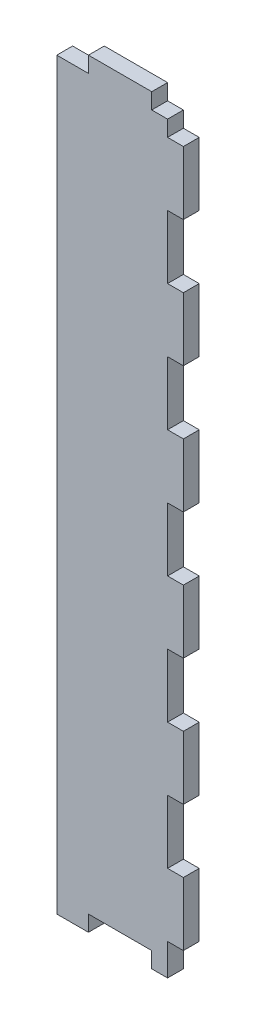
ISO-10303-21;
HEADER;
FILE_DESCRIPTION(('STEP AP214'),'2;1');
FILE_NAME('part.step','',(''),(''),'','','');
FILE_SCHEMA(('AUTOMOTIVE_DESIGN { 1 0 10303 214 1 1 1 1 }'));
ENDSEC;
DATA;
#1=APPLICATION_CONTEXT('core data for automotive mechanical design processes');
#2=APPLICATION_PROTOCOL_DEFINITION('international standard','automotive_design',2000,#1);
#3=PRODUCT_CONTEXT('',#1,'mechanical');
#4=PRODUCT('Part','Part','',(#3));
#5=PRODUCT_RELATED_PRODUCT_CATEGORY('part','',(#4));
#6=PRODUCT_DEFINITION_FORMATION('','',#4);
#7=PRODUCT_DEFINITION_CONTEXT('part definition',#1,'design');
#8=PRODUCT_DEFINITION('design','',#6,#7);
#9=PRODUCT_DEFINITION_SHAPE('','',#8);
#10=(LENGTH_UNIT() NAMED_UNIT(*) SI_UNIT(.MILLI.,.METRE.));
#11=(NAMED_UNIT(*) PLANE_ANGLE_UNIT() SI_UNIT($,.RADIAN.));
#12=(NAMED_UNIT(*) SI_UNIT($,.STERADIAN.) SOLID_ANGLE_UNIT());
#13=UNCERTAINTY_MEASURE_WITH_UNIT(LENGTH_MEASURE(1.E-05),#10,'distance_accuracy_value','');
#14=(GEOMETRIC_REPRESENTATION_CONTEXT(3) GLOBAL_UNCERTAINTY_ASSIGNED_CONTEXT((#13)) GLOBAL_UNIT_ASSIGNED_CONTEXT((#10,
#11,#12)) REPRESENTATION_CONTEXT('',''));
#15=CARTESIAN_POINT('',(0.,0.,0.));
#16=DIRECTION('',(0.,0.,1.));
#17=DIRECTION('',(1.,0.,0.));
#18=AXIS2_PLACEMENT_3D('',#15,#16,#17);
#19=CARTESIAN_POINT('',(0.,0.,3.175));
#20=DIRECTION('',(0.,1.,0.));
#21=DIRECTION('',(0.,0.,1.));
#22=AXIS2_PLACEMENT_3D('',#19,#20,#21);
#23=PLANE('',#22);
#24=DIRECTION('',(1.,0.,0.));
#25=VECTOR('',#24,1.);
#26=CARTESIAN_POINT('',(0.,0.,3.175));
#27=LINE('',#26,#25);
#28=CARTESIAN_POINT('',(19.05,0.,3.175));
#29=VERTEX_POINT('',#28);
#30=CARTESIAN_POINT('',(22.225,0.,3.175));
#31=VERTEX_POINT('',#30);
#32=EDGE_CURVE('E501',#29,#31,#27,.T.);
#33=ORIENTED_EDGE('',*,*,#32,.F.);
#34=DIRECTION('',(0.,0.,1.));
#35=VECTOR('',#34,1.);
#36=CARTESIAN_POINT('',(19.05,0.,0.));
#37=LINE('',#36,#35);
#38=CARTESIAN_POINT('',(19.05,0.,0.));
#39=VERTEX_POINT('',#38);
#40=EDGE_CURVE('E321',#39,#29,#37,.T.);
#41=ORIENTED_EDGE('',*,*,#40,.F.);
#42=DIRECTION('',(1.,0.,0.));
#43=VECTOR('',#42,1.);
#44=CARTESIAN_POINT('',(0.,0.,0.));
#45=LINE('',#44,#43);
#46=CARTESIAN_POINT('',(22.225,0.,0.));
#47=VERTEX_POINT('',#46);
#48=EDGE_CURVE('E513',#39,#47,#45,.T.);
#49=ORIENTED_EDGE('',*,*,#48,.T.);
#50=DIRECTION('',(0.,0.,1.));
#51=VECTOR('',#50,1.);
#52=CARTESIAN_POINT('',(22.225,0.,0.));
#53=LINE('',#52,#51);
#54=EDGE_CURVE('E476',#47,#31,#53,.T.);
#55=ORIENTED_EDGE('',*,*,#54,.T.);
#56=EDGE_LOOP('',(#33,#41,#49,#55));
#57=FACE_BOUND('',#56,.T.);
#58=ADVANCED_FACE('F30',(#57),#23,.F.);
#59=CARTESIAN_POINT('',(25.4,0.,3.175));
#60=DIRECTION('',(-1.,0.,0.));
#61=DIRECTION('',(0.,0.,1.));
#62=AXIS2_PLACEMENT_3D('',#59,#60,#61);
#63=PLANE('',#62);
#64=DIRECTION('',(0.,1.,0.));
#65=VECTOR('',#64,1.);
#66=CARTESIAN_POINT('',(25.4,0.,0.));
#67=LINE('',#66,#65);
#68=CARTESIAN_POINT('',(25.4,6.35000000000002,0.));
#69=VERTEX_POINT('',#68);
#70=CARTESIAN_POINT('',(25.4,19.05,0.));
#71=VERTEX_POINT('',#70);
#72=EDGE_CURVE('E518',#69,#71,#67,.T.);
#73=ORIENTED_EDGE('',*,*,#72,.T.);
#74=DIRECTION('',(0.,0.,1.));
#75=VECTOR('',#74,1.);
#76=CARTESIAN_POINT('',(25.4,19.05,0.));
#77=LINE('',#76,#75);
#78=CARTESIAN_POINT('',(25.4,19.05,3.175));
#79=VERTEX_POINT('',#78);
#80=EDGE_CURVE('E347',#71,#79,#77,.T.);
#81=ORIENTED_EDGE('',*,*,#80,.T.);
#82=DIRECTION('',(0.,1.,0.));
#83=VECTOR('',#82,1.);
#84=CARTESIAN_POINT('',(25.4,0.,3.175));
#85=LINE('',#84,#83);
#86=CARTESIAN_POINT('',(25.4,6.35000000000002,3.175));
#87=VERTEX_POINT('',#86);
#88=EDGE_CURVE('E506',#87,#79,#85,.T.);
#89=ORIENTED_EDGE('',*,*,#88,.F.);
#90=DIRECTION('',(0.,0.,1.));
#91=VECTOR('',#90,1.);
#92=CARTESIAN_POINT('',(25.4,6.35000000000002,0.));
#93=LINE('',#92,#91);
#94=EDGE_CURVE('E471',#69,#87,#93,.T.);
#95=ORIENTED_EDGE('',*,*,#94,.F.);
#96=EDGE_LOOP('',(#73,#81,#89,#95));
#97=FACE_BOUND('',#96,.T.);
#98=ADVANCED_FACE('F647',(#97),#63,.F.);
#99=CARTESIAN_POINT('',(25.4,31.75,3.175));
#100=VERTEX_POINT('',#99);
#101=CARTESIAN_POINT('',(25.4,44.45,3.175));
#102=VERTEX_POINT('',#101);
#103=EDGE_CURVE('E510',#100,#102,#85,.T.);
#104=ORIENTED_EDGE('',*,*,#103,.F.);
#105=DIRECTION('',(0.,0.,1.));
#106=VECTOR('',#105,1.);
#107=CARTESIAN_POINT('',(25.4,31.75,0.));
#108=LINE('',#107,#106);
#109=CARTESIAN_POINT('',(25.4,31.75,0.));
#110=VERTEX_POINT('',#109);
#111=EDGE_CURVE('E340',#110,#100,#108,.T.);
#112=ORIENTED_EDGE('',*,*,#111,.F.);
#113=CARTESIAN_POINT('',(25.4,44.45,0.));
#114=VERTEX_POINT('',#113);
#115=EDGE_CURVE('E521',#110,#114,#67,.T.);
#116=ORIENTED_EDGE('',*,*,#115,.T.);
#117=DIRECTION('',(0.,0.,1.));
#118=VECTOR('',#117,1.);
#119=CARTESIAN_POINT('',(25.4,44.45,0.));
#120=LINE('',#119,#118);
#121=EDGE_CURVE('E374',#114,#102,#120,.T.);
#122=ORIENTED_EDGE('',*,*,#121,.T.);
#123=EDGE_LOOP('',(#104,#112,#116,#122));
#124=FACE_BOUND('',#123,.T.);
#125=ADVANCED_FACE('F583',(#124),#63,.F.);
#126=CARTESIAN_POINT('',(25.4,57.15,3.175));
#127=VERTEX_POINT('',#126);
#128=CARTESIAN_POINT('',(25.4,69.85,3.175));
#129=VERTEX_POINT('',#128);
#130=EDGE_CURVE('E598',#127,#129,#85,.T.);
#131=ORIENTED_EDGE('',*,*,#130,.F.);
#132=DIRECTION('',(0.,0.,1.));
#133=VECTOR('',#132,1.);
#134=CARTESIAN_POINT('',(25.4,57.15,0.));
#135=LINE('',#134,#133);
#136=CARTESIAN_POINT('',(25.4,57.15,0.));
#137=VERTEX_POINT('',#136);
#138=EDGE_CURVE('E366',#137,#127,#135,.T.);
#139=ORIENTED_EDGE('',*,*,#138,.F.);
#140=CARTESIAN_POINT('',(25.4,69.85,0.));
#141=VERTEX_POINT('',#140);
#142=EDGE_CURVE('E569',#137,#141,#67,.T.);
#143=ORIENTED_EDGE('',*,*,#142,.T.);
#144=DIRECTION('',(0.,0.,1.));
#145=VECTOR('',#144,1.);
#146=CARTESIAN_POINT('',(25.4,69.85,0.));
#147=LINE('',#146,#145);
#148=EDGE_CURVE('E401',#141,#129,#147,.T.);
#149=ORIENTED_EDGE('',*,*,#148,.T.);
#150=EDGE_LOOP('',(#131,#139,#143,#149));
#151=FACE_BOUND('',#150,.T.);
#152=ADVANCED_FACE('F640',(#151),#63,.F.);
#153=CARTESIAN_POINT('',(25.4,82.55,3.175));
#154=VERTEX_POINT('',#153);
#155=CARTESIAN_POINT('',(25.4,95.25,3.175));
#156=VERTEX_POINT('',#155);
#157=EDGE_CURVE('E599',#154,#156,#85,.T.);
#158=ORIENTED_EDGE('',*,*,#157,.F.);
#159=DIRECTION('',(0.,0.,1.));
#160=VECTOR('',#159,1.);
#161=CARTESIAN_POINT('',(25.4,82.55,0.));
#162=LINE('',#161,#160);
#163=CARTESIAN_POINT('',(25.4,82.55,0.));
#164=VERTEX_POINT('',#163);
#165=EDGE_CURVE('E393',#164,#154,#162,.T.);
#166=ORIENTED_EDGE('',*,*,#165,.F.);
#167=CARTESIAN_POINT('',(25.4,95.25,0.));
#168=VERTEX_POINT('',#167);
#169=EDGE_CURVE('E564',#164,#168,#67,.T.);
#170=ORIENTED_EDGE('',*,*,#169,.T.);
#171=DIRECTION('',(0.,0.,1.));
#172=VECTOR('',#171,1.);
#173=CARTESIAN_POINT('',(25.4,95.25,0.));
#174=LINE('',#173,#172);
#175=EDGE_CURVE('E428',#168,#156,#174,.T.);
#176=ORIENTED_EDGE('',*,*,#175,.T.);
#177=EDGE_LOOP('',(#158,#166,#170,#176));
#178=FACE_BOUND('',#177,.T.);
#179=ADVANCED_FACE('F630',(#178),#63,.F.);
#180=CARTESIAN_POINT('',(25.4,107.95,3.175));
#181=VERTEX_POINT('',#180);
#182=CARTESIAN_POINT('',(25.4,120.65,3.175));
#183=VERTEX_POINT('',#182);
#184=EDGE_CURVE('E601',#181,#183,#85,.T.);
#185=ORIENTED_EDGE('',*,*,#184,.F.);
#186=DIRECTION('',(0.,0.,1.));
#187=VECTOR('',#186,1.);
#188=CARTESIAN_POINT('',(25.4,107.95,0.));
#189=LINE('',#188,#187);
#190=CARTESIAN_POINT('',(25.4,107.95,0.));
#191=VERTEX_POINT('',#190);
#192=EDGE_CURVE('E420',#191,#181,#189,.T.);
#193=ORIENTED_EDGE('',*,*,#192,.F.);
#194=CARTESIAN_POINT('',(25.4,120.65,0.));
#195=VERTEX_POINT('',#194);
#196=EDGE_CURVE('E563',#191,#195,#67,.T.);
#197=ORIENTED_EDGE('',*,*,#196,.T.);
#198=DIRECTION('',(0.,0.,1.));
#199=VECTOR('',#198,1.);
#200=CARTESIAN_POINT('',(25.4,120.65,0.));
#201=LINE('',#200,#199);
#202=EDGE_CURVE('E455',#195,#183,#201,.T.);
#203=ORIENTED_EDGE('',*,*,#202,.T.);
#204=EDGE_LOOP('',(#185,#193,#197,#203));
#205=FACE_BOUND('',#204,.T.);
#206=ADVANCED_FACE('F620',(#205),#63,.F.);
#207=CARTESIAN_POINT('',(0.,0.,3.175));
#208=DIRECTION('',(1.,0.,0.));
#209=DIRECTION('',(0.,0.,-1.));
#210=AXIS2_PLACEMENT_3D('',#207,#208,#209);
#211=PLANE('',#210);
#212=DIRECTION('',(0.,-1.,0.));
#213=VECTOR('',#212,1.);
#214=CARTESIAN_POINT('',(0.,0.,3.175));
#215=LINE('',#214,#213);
#216=CARTESIAN_POINT('',(0.,149.225,3.175));
#217=VERTEX_POINT('',#216);
#218=CARTESIAN_POINT('',(0.,0.,3.175));
#219=VERTEX_POINT('',#218);
#220=EDGE_CURVE('E499',#217,#219,#215,.T.);
#221=ORIENTED_EDGE('',*,*,#220,.F.);
#222=DIRECTION('',(0.,0.,1.));
#223=VECTOR('',#222,1.);
#224=CARTESIAN_POINT('',(0.,149.225,0.));
#225=LINE('',#224,#223);
#226=CARTESIAN_POINT('',(0.,149.225,0.));
#227=VERTEX_POINT('',#226);
#228=EDGE_CURVE('E292',#227,#217,#225,.T.);
#229=ORIENTED_EDGE('',*,*,#228,.F.);
#230=DIRECTION('',(0.,-1.,0.));
#231=VECTOR('',#230,1.);
#232=CARTESIAN_POINT('',(0.,0.,0.));
#233=LINE('',#232,#231);
#234=CARTESIAN_POINT('',(0.,0.,0.));
#235=VERTEX_POINT('',#234);
#236=EDGE_CURVE('E496',#227,#235,#233,.T.);
#237=ORIENTED_EDGE('',*,*,#236,.T.);
#238=DIRECTION('',(0.,0.,-1.));
#239=VECTOR('',#238,1.);
#240=CARTESIAN_POINT('',(0.,0.,3.175));
#241=LINE('',#240,#239);
#242=EDGE_CURVE('E38',#219,#235,#241,.T.);
#243=ORIENTED_EDGE('',*,*,#242,.F.);
#244=EDGE_LOOP('',(#221,#229,#237,#243));
#245=FACE_BOUND('',#244,.T.);
#246=ADVANCED_FACE('F32',(#245),#211,.F.);
#247=CARTESIAN_POINT('',(6.35,0.,0.));
#248=VERTEX_POINT('',#247);
#249=EDGE_CURVE('E514',#235,#248,#45,.T.);
#250=ORIENTED_EDGE('',*,*,#249,.T.);
#251=DIRECTION('',(0.,0.,1.));
#252=VECTOR('',#251,1.);
#253=CARTESIAN_POINT('',(6.35,0.,0.));
#254=LINE('',#253,#252);
#255=CARTESIAN_POINT('',(6.35,0.,3.175));
#256=VERTEX_POINT('',#255);
#257=EDGE_CURVE('E324',#248,#256,#254,.T.);
#258=ORIENTED_EDGE('',*,*,#257,.T.);
#259=EDGE_CURVE('E502',#219,#256,#27,.T.);
#260=ORIENTED_EDGE('',*,*,#259,.F.);
#261=ORIENTED_EDGE('',*,*,#242,.T.);
#262=EDGE_LOOP('',(#250,#258,#260,#261));
#263=FACE_BOUND('',#262,.T.);
#264=ADVANCED_FACE('F526',(#263),#23,.F.);
#265=CARTESIAN_POINT('',(25.4,133.35,3.175));
#266=VERTEX_POINT('',#265);
#267=CARTESIAN_POINT('',(25.4,146.05,3.175));
#268=VERTEX_POINT('',#267);
#269=EDGE_CURVE('E505',#266,#268,#85,.T.);
#270=ORIENTED_EDGE('',*,*,#269,.F.);
#271=DIRECTION('',(0.,0.,1.));
#272=VECTOR('',#271,1.);
#273=CARTESIAN_POINT('',(25.4,133.35,0.));
#274=LINE('',#273,#272);
#275=CARTESIAN_POINT('',(25.4,133.35,0.));
#276=VERTEX_POINT('',#275);
#277=EDGE_CURVE('E447',#276,#266,#274,.T.);
#278=ORIENTED_EDGE('',*,*,#277,.F.);
#279=CARTESIAN_POINT('',(25.4,146.05,0.));
#280=VERTEX_POINT('',#279);
#281=EDGE_CURVE('E517',#276,#280,#67,.T.);
#282=ORIENTED_EDGE('',*,*,#281,.T.);
#283=DIRECTION('',(0.,0.,1.));
#284=VECTOR('',#283,1.);
#285=CARTESIAN_POINT('',(25.4,146.05,0.));
#286=LINE('',#285,#284);
#287=EDGE_CURVE('E493',#280,#268,#286,.T.);
#288=ORIENTED_EDGE('',*,*,#287,.T.);
#289=EDGE_LOOP('',(#270,#278,#282,#288));
#290=FACE_BOUND('',#289,.T.);
#291=ADVANCED_FACE('F611',(#290),#63,.F.);
#292=CARTESIAN_POINT('',(0.,152.4,3.175));
#293=DIRECTION('',(0.,-1.,0.));
#294=DIRECTION('',(0.,0.,-1.));
#295=AXIS2_PLACEMENT_3D('',#292,#293,#294);
#296=PLANE('',#295);
#297=DIRECTION('',(-1.,0.,0.));
#298=VECTOR('',#297,1.);
#299=CARTESIAN_POINT('',(0.,152.4,3.175));
#300=LINE('',#299,#298);
#301=CARTESIAN_POINT('',(19.05,152.4,3.175));
#302=VERTEX_POINT('',#301);
#303=CARTESIAN_POINT('',(6.35,152.4,3.175));
#304=VERTEX_POINT('',#303);
#305=EDGE_CURVE('E509',#302,#304,#300,.T.);
#306=ORIENTED_EDGE('',*,*,#305,.F.);
#307=DIRECTION('',(0.,0.,1.));
#308=VECTOR('',#307,1.);
#309=CARTESIAN_POINT('',(19.05,152.4,0.));
#310=LINE('',#309,#308);
#311=CARTESIAN_POINT('',(19.05,152.4,0.));
#312=VERTEX_POINT('',#311);
#313=EDGE_CURVE('E270',#312,#302,#310,.T.);
#314=ORIENTED_EDGE('',*,*,#313,.F.);
#315=DIRECTION('',(-1.,0.,0.));
#316=VECTOR('',#315,1.);
#317=CARTESIAN_POINT('',(0.,152.4,0.));
#318=LINE('',#317,#316);
#319=CARTESIAN_POINT('',(6.35,152.4,0.));
#320=VERTEX_POINT('',#319);
#321=EDGE_CURVE('E280',#312,#320,#318,.T.);
#322=ORIENTED_EDGE('',*,*,#321,.T.);
#323=DIRECTION('',(0.,0.,1.));
#324=VECTOR('',#323,1.);
#325=CARTESIAN_POINT('',(6.35,152.4,0.));
#326=LINE('',#325,#324);
#327=EDGE_CURVE('E297',#320,#304,#326,.T.);
#328=ORIENTED_EDGE('',*,*,#327,.T.);
#329=EDGE_LOOP('',(#306,#314,#322,#328));
#330=FACE_BOUND('',#329,.T.);
#331=ADVANCED_FACE('F550',(#330),#296,.F.);
#332=CARTESIAN_POINT('',(0.,152.4,3.175));
#333=DIRECTION('',(0.,0.,-1.));
#334=DIRECTION('',(-1.,0.,0.));
#335=AXIS2_PLACEMENT_3D('',#332,#333,#334);
#336=PLANE('',#335);
#337=DIRECTION('',(1.,0.,0.));
#338=VECTOR('',#337,1.);
#339=CARTESIAN_POINT('',(19.05,149.225,3.175));
#340=LINE('',#339,#338);
#341=CARTESIAN_POINT('',(19.05,149.225,3.175));
#342=VERTEX_POINT('',#341);
#343=CARTESIAN_POINT('',(22.225,149.225,3.175));
#344=VERTEX_POINT('',#343);
#345=EDGE_CURVE('E45',#342,#344,#340,.T.);
#346=ORIENTED_EDGE('',*,*,#345,.F.);
#347=DIRECTION('',(0.,-1.,0.));
#348=VECTOR('',#347,1.);
#349=CARTESIAN_POINT('',(19.05,152.4,3.175));
#350=LINE('',#349,#348);
#351=EDGE_CURVE('E269',#302,#342,#350,.T.);
#352=ORIENTED_EDGE('',*,*,#351,.F.);
#353=ORIENTED_EDGE('',*,*,#305,.T.);
#354=DIRECTION('',(0.,1.,0.));
#355=VECTOR('',#354,1.);
#356=CARTESIAN_POINT('',(6.35,152.4,3.175));
#357=LINE('',#356,#355);
#358=CARTESIAN_POINT('',(6.35,149.225,3.175));
#359=VERTEX_POINT('',#358);
#360=EDGE_CURVE('E290',#359,#304,#357,.T.);
#361=ORIENTED_EDGE('',*,*,#360,.F.);
#362=DIRECTION('',(1.,0.,0.));
#363=VECTOR('',#362,1.);
#364=CARTESIAN_POINT('',(0.,149.225,3.175));
#365=LINE('',#364,#363);
#366=EDGE_CURVE('E285',#217,#359,#365,.T.);
#367=ORIENTED_EDGE('',*,*,#366,.F.);
#368=ORIENTED_EDGE('',*,*,#220,.T.);
#369=ORIENTED_EDGE('',*,*,#259,.T.);
#370=DIRECTION('',(0.,-1.,0.));
#371=VECTOR('',#370,1.);
#372=CARTESIAN_POINT('',(6.35,0.,3.175));
#373=LINE('',#372,#371);
#374=CARTESIAN_POINT('',(6.35,3.175,3.175));
#375=VERTEX_POINT('',#374);
#376=EDGE_CURVE('E308',#375,#256,#373,.T.);
#377=ORIENTED_EDGE('',*,*,#376,.F.);
#378=DIRECTION('',(-1.,0.,0.));
#379=VECTOR('',#378,1.);
#380=CARTESIAN_POINT('',(19.05,3.175,3.175));
#381=LINE('',#380,#379);
#382=CARTESIAN_POINT('',(19.05,3.175,3.175));
#383=VERTEX_POINT('',#382);
#384=EDGE_CURVE('E317',#383,#375,#381,.T.);
#385=ORIENTED_EDGE('',*,*,#384,.F.);
#386=DIRECTION('',(0.,1.,0.));
#387=VECTOR('',#386,1.);
#388=CARTESIAN_POINT('',(19.05,0.,3.175));
#389=LINE('',#388,#387);
#390=EDGE_CURVE('E300',#29,#383,#389,.T.);
#391=ORIENTED_EDGE('',*,*,#390,.F.);
#392=ORIENTED_EDGE('',*,*,#32,.T.);
#393=DIRECTION('',(0.,-1.,0.));
#394=VECTOR('',#393,1.);
#395=CARTESIAN_POINT('',(22.225,0.,3.175));
#396=LINE('',#395,#394);
#397=CARTESIAN_POINT('',(22.225,6.35000000000002,3.175));
#398=VERTEX_POINT('',#397);
#399=EDGE_CURVE('E468',#398,#31,#396,.T.);
#400=ORIENTED_EDGE('',*,*,#399,.F.);
#401=DIRECTION('',(-1.,0.,0.));
#402=VECTOR('',#401,1.);
#403=CARTESIAN_POINT('',(25.4,6.35000000000002,3.175));
#404=LINE('',#403,#402);
#405=EDGE_CURVE('E458',#87,#398,#404,.T.);
#406=ORIENTED_EDGE('',*,*,#405,.F.);
#407=ORIENTED_EDGE('',*,*,#88,.T.);
#408=DIRECTION('',(1.,0.,0.));
#409=VECTOR('',#408,1.);
#410=CARTESIAN_POINT('',(25.4,19.05,3.175));
#411=LINE('',#410,#409);
#412=CARTESIAN_POINT('',(22.225,19.05,3.175));
#413=VERTEX_POINT('',#412);
#414=EDGE_CURVE('E334',#413,#79,#411,.T.);
#415=ORIENTED_EDGE('',*,*,#414,.F.);
#416=DIRECTION('',(0.,-1.,0.));
#417=VECTOR('',#416,1.);
#418=CARTESIAN_POINT('',(22.225,31.75,3.175));
#419=LINE('',#418,#417);
#420=CARTESIAN_POINT('',(22.225,31.75,3.175));
#421=VERTEX_POINT('',#420);
#422=EDGE_CURVE('E343',#421,#413,#419,.T.);
#423=ORIENTED_EDGE('',*,*,#422,.F.);
#424=DIRECTION('',(-1.,0.,0.));
#425=VECTOR('',#424,1.);
#426=CARTESIAN_POINT('',(25.4,31.75,3.175));
#427=LINE('',#426,#425);
#428=EDGE_CURVE('E323',#100,#421,#427,.T.);
#429=ORIENTED_EDGE('',*,*,#428,.F.);
#430=ORIENTED_EDGE('',*,*,#103,.T.);
#431=DIRECTION('',(1.,0.,0.));
#432=VECTOR('',#431,1.);
#433=CARTESIAN_POINT('',(25.4,44.45,3.175));
#434=LINE('',#433,#432);
#435=CARTESIAN_POINT('',(22.225,44.45,3.175));
#436=VERTEX_POINT('',#435);
#437=EDGE_CURVE('E360',#436,#102,#434,.T.);
#438=ORIENTED_EDGE('',*,*,#437,.F.);
#439=DIRECTION('',(0.,-1.,0.));
#440=VECTOR('',#439,1.);
#441=CARTESIAN_POINT('',(22.225,57.15,3.175));
#442=LINE('',#441,#440);
#443=CARTESIAN_POINT('',(22.225,57.15,3.175));
#444=VERTEX_POINT('',#443);
#445=EDGE_CURVE('E369',#444,#436,#442,.T.);
#446=ORIENTED_EDGE('',*,*,#445,.F.);
#447=DIRECTION('',(-1.,0.,0.));
#448=VECTOR('',#447,1.);
#449=CARTESIAN_POINT('',(25.4,57.15,3.175));
#450=LINE('',#449,#448);
#451=EDGE_CURVE('E350',#127,#444,#450,.T.);
#452=ORIENTED_EDGE('',*,*,#451,.F.);
#453=ORIENTED_EDGE('',*,*,#130,.T.);
#454=DIRECTION('',(1.,0.,0.));
#455=VECTOR('',#454,1.);
#456=CARTESIAN_POINT('',(25.4,69.85,3.175));
#457=LINE('',#456,#455);
#458=CARTESIAN_POINT('',(22.225,69.85,3.175));
#459=VERTEX_POINT('',#458);
#460=EDGE_CURVE('E387',#459,#129,#457,.T.);
#461=ORIENTED_EDGE('',*,*,#460,.F.);
#462=DIRECTION('',(0.,-1.,0.));
#463=VECTOR('',#462,1.);
#464=CARTESIAN_POINT('',(22.225,82.55,3.175));
#465=LINE('',#464,#463);
#466=CARTESIAN_POINT('',(22.225,82.55,3.175));
#467=VERTEX_POINT('',#466);
#468=EDGE_CURVE('E396',#467,#459,#465,.T.);
#469=ORIENTED_EDGE('',*,*,#468,.F.);
#470=DIRECTION('',(-1.,0.,0.));
#471=VECTOR('',#470,1.);
#472=CARTESIAN_POINT('',(25.4,82.55,3.175));
#473=LINE('',#472,#471);
#474=EDGE_CURVE('E377',#154,#467,#473,.T.);
#475=ORIENTED_EDGE('',*,*,#474,.F.);
#476=ORIENTED_EDGE('',*,*,#157,.T.);
#477=DIRECTION('',(1.,0.,0.));
#478=VECTOR('',#477,1.);
#479=CARTESIAN_POINT('',(25.4,95.25,3.175));
#480=LINE('',#479,#478);
#481=CARTESIAN_POINT('',(22.225,95.25,3.175));
#482=VERTEX_POINT('',#481);
#483=EDGE_CURVE('E414',#482,#156,#480,.T.);
#484=ORIENTED_EDGE('',*,*,#483,.F.);
#485=DIRECTION('',(0.,-1.,0.));
#486=VECTOR('',#485,1.);
#487=CARTESIAN_POINT('',(22.225,107.95,3.175));
#488=LINE('',#487,#486);
#489=CARTESIAN_POINT('',(22.225,107.95,3.175));
#490=VERTEX_POINT('',#489);
#491=EDGE_CURVE('E423',#490,#482,#488,.T.);
#492=ORIENTED_EDGE('',*,*,#491,.F.);
#493=DIRECTION('',(-1.,0.,0.));
#494=VECTOR('',#493,1.);
#495=CARTESIAN_POINT('',(25.4,107.95,3.175));
#496=LINE('',#495,#494);
#497=EDGE_CURVE('E404',#181,#490,#496,.T.);
#498=ORIENTED_EDGE('',*,*,#497,.F.);
#499=ORIENTED_EDGE('',*,*,#184,.T.);
#500=DIRECTION('',(1.,0.,0.));
#501=VECTOR('',#500,1.);
#502=CARTESIAN_POINT('',(25.4,120.65,3.175));
#503=LINE('',#502,#501);
#504=CARTESIAN_POINT('',(22.225,120.65,3.175));
#505=VERTEX_POINT('',#504);
#506=EDGE_CURVE('E441',#505,#183,#503,.T.);
#507=ORIENTED_EDGE('',*,*,#506,.F.);
#508=DIRECTION('',(0.,-1.,0.));
#509=VECTOR('',#508,1.);
#510=CARTESIAN_POINT('',(22.225,133.35,3.175));
#511=LINE('',#510,#509);
#512=CARTESIAN_POINT('',(22.225,133.35,3.175));
#513=VERTEX_POINT('',#512);
#514=EDGE_CURVE('E450',#513,#505,#511,.T.);
#515=ORIENTED_EDGE('',*,*,#514,.F.);
#516=DIRECTION('',(-1.,0.,0.));
#517=VECTOR('',#516,1.);
#518=CARTESIAN_POINT('',(25.4,133.35,3.175));
#519=LINE('',#518,#517);
#520=EDGE_CURVE('E431',#266,#513,#519,.T.);
#521=ORIENTED_EDGE('',*,*,#520,.F.);
#522=ORIENTED_EDGE('',*,*,#269,.T.);
#523=DIRECTION('',(1.,0.,0.));
#524=VECTOR('',#523,1.);
#525=CARTESIAN_POINT('',(25.4,146.05,3.175));
#526=LINE('',#525,#524);
#527=CARTESIAN_POINT('',(22.225,146.05,3.175));
#528=VERTEX_POINT('',#527);
#529=EDGE_CURVE('E486',#528,#268,#526,.T.);
#530=ORIENTED_EDGE('',*,*,#529,.F.);
#531=DIRECTION('',(0.,-1.,0.));
#532=VECTOR('',#531,1.);
#533=CARTESIAN_POINT('',(22.225,146.05,3.175));
#534=LINE('',#533,#532);
#535=EDGE_CURVE('E479',#344,#528,#534,.T.);
#536=ORIENTED_EDGE('',*,*,#535,.F.);
#537=EDGE_LOOP('',(#346,#352,#353,#361,#367,#368,#369,#377,#385,#391,#392,#400,#406,#407,#415,
#423,#429,#430,#438,#446,#452,#453,#461,#469,#475,#476,#484,#492,#498,#499,#507,#515,#521,#522,
#530,#536));
#538=FACE_BOUND('',#537,.T.);
#539=ADVANCED_FACE('F542',(#538),#336,.F.);
#540=CARTESIAN_POINT('',(0.,152.4,0.));
#541=DIRECTION('',(0.,0.,-1.));
#542=DIRECTION('',(-1.,0.,0.));
#543=AXIS2_PLACEMENT_3D('',#540,#541,#542);
#544=PLANE('',#543);
#545=DIRECTION('',(0.,-1.,0.));
#546=VECTOR('',#545,1.);
#547=CARTESIAN_POINT('',(19.05,152.4,0.));
#548=LINE('',#547,#546);
#549=CARTESIAN_POINT('',(19.05,149.225,0.));
#550=VERTEX_POINT('',#549);
#551=EDGE_CURVE('E266',#312,#550,#548,.T.);
#552=ORIENTED_EDGE('',*,*,#551,.T.);
#553=DIRECTION('',(1.,0.,0.));
#554=VECTOR('',#553,1.);
#555=CARTESIAN_POINT('',(19.05,149.225,0.));
#556=LINE('',#555,#554);
#557=CARTESIAN_POINT('',(22.225,149.225,0.));
#558=VERTEX_POINT('',#557);
#559=EDGE_CURVE('E271',#550,#558,#556,.T.);
#560=ORIENTED_EDGE('',*,*,#559,.T.);
#561=DIRECTION('',(0.,-1.,0.));
#562=VECTOR('',#561,1.);
#563=CARTESIAN_POINT('',(22.225,146.05,0.));
#564=LINE('',#563,#562);
#565=CARTESIAN_POINT('',(22.225,146.05,0.));
#566=VERTEX_POINT('',#565);
#567=EDGE_CURVE('E483',#558,#566,#564,.T.);
#568=ORIENTED_EDGE('',*,*,#567,.T.);
#569=DIRECTION('',(1.,0.,0.));
#570=VECTOR('',#569,1.);
#571=CARTESIAN_POINT('',(25.4,146.05,0.));
#572=LINE('',#571,#570);
#573=EDGE_CURVE('E485',#566,#280,#572,.T.);
#574=ORIENTED_EDGE('',*,*,#573,.T.);
#575=ORIENTED_EDGE('',*,*,#281,.F.);
#576=DIRECTION('',(-1.,0.,0.));
#577=VECTOR('',#576,1.);
#578=CARTESIAN_POINT('',(25.4,133.35,0.));
#579=LINE('',#578,#577);
#580=CARTESIAN_POINT('',(22.225,133.35,0.));
#581=VERTEX_POINT('',#580);
#582=EDGE_CURVE('E437',#276,#581,#579,.T.);
#583=ORIENTED_EDGE('',*,*,#582,.T.);
#584=DIRECTION('',(0.,-1.,0.));
#585=VECTOR('',#584,1.);
#586=CARTESIAN_POINT('',(22.225,133.35,0.));
#587=LINE('',#586,#585);
#588=CARTESIAN_POINT('',(22.225,120.65,0.));
#589=VERTEX_POINT('',#588);
#590=EDGE_CURVE('E440',#581,#589,#587,.T.);
#591=ORIENTED_EDGE('',*,*,#590,.T.);
#592=DIRECTION('',(1.,0.,0.));
#593=VECTOR('',#592,1.);
#594=CARTESIAN_POINT('',(25.4,120.65,0.));
#595=LINE('',#594,#593);
#596=EDGE_CURVE('E444',#589,#195,#595,.T.);
#597=ORIENTED_EDGE('',*,*,#596,.T.);
#598=ORIENTED_EDGE('',*,*,#196,.F.);
#599=DIRECTION('',(-1.,0.,0.));
#600=VECTOR('',#599,1.);
#601=CARTESIAN_POINT('',(25.4,107.95,0.));
#602=LINE('',#601,#600);
#603=CARTESIAN_POINT('',(22.225,107.95,0.));
#604=VERTEX_POINT('',#603);
#605=EDGE_CURVE('E410',#191,#604,#602,.T.);
#606=ORIENTED_EDGE('',*,*,#605,.T.);
#607=DIRECTION('',(0.,-1.,0.));
#608=VECTOR('',#607,1.);
#609=CARTESIAN_POINT('',(22.225,107.95,0.));
#610=LINE('',#609,#608);
#611=CARTESIAN_POINT('',(22.225,95.25,0.));
#612=VERTEX_POINT('',#611);
#613=EDGE_CURVE('E413',#604,#612,#610,.T.);
#614=ORIENTED_EDGE('',*,*,#613,.T.);
#615=DIRECTION('',(1.,0.,0.));
#616=VECTOR('',#615,1.);
#617=CARTESIAN_POINT('',(25.4,95.25,0.));
#618=LINE('',#617,#616);
#619=EDGE_CURVE('E417',#612,#168,#618,.T.);
#620=ORIENTED_EDGE('',*,*,#619,.T.);
#621=ORIENTED_EDGE('',*,*,#169,.F.);
#622=DIRECTION('',(-1.,0.,0.));
#623=VECTOR('',#622,1.);
#624=CARTESIAN_POINT('',(25.4,82.55,0.));
#625=LINE('',#624,#623);
#626=CARTESIAN_POINT('',(22.225,82.55,0.));
#627=VERTEX_POINT('',#626);
#628=EDGE_CURVE('E383',#164,#627,#625,.T.);
#629=ORIENTED_EDGE('',*,*,#628,.T.);
#630=DIRECTION('',(0.,-1.,0.));
#631=VECTOR('',#630,1.);
#632=CARTESIAN_POINT('',(22.225,82.55,0.));
#633=LINE('',#632,#631);
#634=CARTESIAN_POINT('',(22.225,69.85,0.));
#635=VERTEX_POINT('',#634);
#636=EDGE_CURVE('E386',#627,#635,#633,.T.);
#637=ORIENTED_EDGE('',*,*,#636,.T.);
#638=DIRECTION('',(1.,0.,0.));
#639=VECTOR('',#638,1.);
#640=CARTESIAN_POINT('',(25.4,69.85,0.));
#641=LINE('',#640,#639);
#642=EDGE_CURVE('E390',#635,#141,#641,.T.);
#643=ORIENTED_EDGE('',*,*,#642,.T.);
#644=ORIENTED_EDGE('',*,*,#142,.F.);
#645=DIRECTION('',(-1.,0.,0.));
#646=VECTOR('',#645,1.);
#647=CARTESIAN_POINT('',(25.4,57.15,0.));
#648=LINE('',#647,#646);
#649=CARTESIAN_POINT('',(22.225,57.15,0.));
#650=VERTEX_POINT('',#649);
#651=EDGE_CURVE('E356',#137,#650,#648,.T.);
#652=ORIENTED_EDGE('',*,*,#651,.T.);
#653=DIRECTION('',(0.,-1.,0.));
#654=VECTOR('',#653,1.);
#655=CARTESIAN_POINT('',(22.225,57.15,0.));
#656=LINE('',#655,#654);
#657=CARTESIAN_POINT('',(22.225,44.45,0.));
#658=VERTEX_POINT('',#657);
#659=EDGE_CURVE('E359',#650,#658,#656,.T.);
#660=ORIENTED_EDGE('',*,*,#659,.T.);
#661=DIRECTION('',(1.,0.,0.));
#662=VECTOR('',#661,1.);
#663=CARTESIAN_POINT('',(25.4,44.45,0.));
#664=LINE('',#663,#662);
#665=EDGE_CURVE('E363',#658,#114,#664,.T.);
#666=ORIENTED_EDGE('',*,*,#665,.T.);
#667=ORIENTED_EDGE('',*,*,#115,.F.);
#668=DIRECTION('',(-1.,0.,0.));
#669=VECTOR('',#668,1.);
#670=CARTESIAN_POINT('',(25.4,31.75,0.));
#671=LINE('',#670,#669);
#672=CARTESIAN_POINT('',(22.225,31.75,0.));
#673=VERTEX_POINT('',#672);
#674=EDGE_CURVE('E330',#110,#673,#671,.T.);
#675=ORIENTED_EDGE('',*,*,#674,.T.);
#676=DIRECTION('',(0.,-1.,0.));
#677=VECTOR('',#676,1.);
#678=CARTESIAN_POINT('',(22.225,31.75,0.));
#679=LINE('',#678,#677);
#680=CARTESIAN_POINT('',(22.225,19.05,0.));
#681=VERTEX_POINT('',#680);
#682=EDGE_CURVE('E333',#673,#681,#679,.T.);
#683=ORIENTED_EDGE('',*,*,#682,.T.);
#684=DIRECTION('',(1.,0.,0.));
#685=VECTOR('',#684,1.);
#686=CARTESIAN_POINT('',(25.4,19.05,0.));
#687=LINE('',#686,#685);
#688=EDGE_CURVE('E337',#681,#71,#687,.T.);
#689=ORIENTED_EDGE('',*,*,#688,.T.);
#690=ORIENTED_EDGE('',*,*,#72,.F.);
#691=DIRECTION('',(-1.,0.,0.));
#692=VECTOR('',#691,1.);
#693=CARTESIAN_POINT('',(25.4,6.35000000000002,0.));
#694=LINE('',#693,#692);
#695=CARTESIAN_POINT('',(22.225,6.35000000000002,0.));
#696=VERTEX_POINT('',#695);
#697=EDGE_CURVE('E464',#69,#696,#694,.T.);
#698=ORIENTED_EDGE('',*,*,#697,.T.);
#699=DIRECTION('',(0.,-1.,0.));
#700=VECTOR('',#699,1.);
#701=CARTESIAN_POINT('',(22.225,0.,0.));
#702=LINE('',#701,#700);
#703=EDGE_CURVE('E467',#696,#47,#702,.T.);
#704=ORIENTED_EDGE('',*,*,#703,.T.);
#705=ORIENTED_EDGE('',*,*,#48,.F.);
#706=DIRECTION('',(0.,1.,0.));
#707=VECTOR('',#706,1.);
#708=CARTESIAN_POINT('',(19.05,0.,0.));
#709=LINE('',#708,#707);
#710=CARTESIAN_POINT('',(19.05,3.175,0.));
#711=VERTEX_POINT('',#710);
#712=EDGE_CURVE('E304',#39,#711,#709,.T.);
#713=ORIENTED_EDGE('',*,*,#712,.T.);
#714=DIRECTION('',(-1.,0.,0.));
#715=VECTOR('',#714,1.);
#716=CARTESIAN_POINT('',(19.05,3.175,0.));
#717=LINE('',#716,#715);
#718=CARTESIAN_POINT('',(6.35,3.17500000000001,0.));
#719=VERTEX_POINT('',#718);
#720=EDGE_CURVE('E307',#711,#719,#717,.T.);
#721=ORIENTED_EDGE('',*,*,#720,.T.);
#722=DIRECTION('',(0.,-1.,0.));
#723=VECTOR('',#722,1.);
#724=CARTESIAN_POINT('',(6.35,0.,0.));
#725=LINE('',#724,#723);
#726=EDGE_CURVE('E311',#719,#248,#725,.T.);
#727=ORIENTED_EDGE('',*,*,#726,.T.);
#728=ORIENTED_EDGE('',*,*,#249,.F.);
#729=ORIENTED_EDGE('',*,*,#236,.F.);
#730=DIRECTION('',(1.,0.,0.));
#731=VECTOR('',#730,1.);
#732=CARTESIAN_POINT('',(0.,149.225,0.));
#733=LINE('',#732,#731);
#734=CARTESIAN_POINT('',(6.35,149.225,0.));
#735=VERTEX_POINT('',#734);
#736=EDGE_CURVE('E287',#227,#735,#733,.T.);
#737=ORIENTED_EDGE('',*,*,#736,.T.);
#738=DIRECTION('',(0.,1.,0.));
#739=VECTOR('',#738,1.);
#740=CARTESIAN_POINT('',(6.35,152.4,0.));
#741=LINE('',#740,#739);
#742=EDGE_CURVE('E52',#735,#320,#741,.T.);
#743=ORIENTED_EDGE('',*,*,#742,.T.);
#744=ORIENTED_EDGE('',*,*,#321,.F.);
#745=EDGE_LOOP('',(#552,#560,#568,#574,#575,#583,#591,#597,#598,#606,#614,#620,#621,#629,#637,
#643,#644,#652,#660,#666,#667,#675,#683,#689,#690,#698,#704,#705,#713,#721,#727,#728,#729,#737,
#743,#744));
#746=FACE_BOUND('',#745,.T.);
#747=ADVANCED_FACE('F279',(#746),#544,.T.);
#748=CARTESIAN_POINT('',(25.4,146.05,0.));
#749=DIRECTION('',(0.,-1.,0.));
#750=DIRECTION('',(0.,0.,-1.));
#751=AXIS2_PLACEMENT_3D('',#748,#749,#750);
#752=PLANE('',#751);
#753=ORIENTED_EDGE('',*,*,#529,.T.);
#754=ORIENTED_EDGE('',*,*,#287,.F.);
#755=ORIENTED_EDGE('',*,*,#573,.F.);
#756=DIRECTION('',(0.,0.,1.));
#757=VECTOR('',#756,1.);
#758=CARTESIAN_POINT('',(22.225,146.05,0.));
#759=LINE('',#758,#757);
#760=EDGE_CURVE('E489',#566,#528,#759,.T.);
#761=ORIENTED_EDGE('',*,*,#760,.T.);
#762=EDGE_LOOP('',(#753,#754,#755,#761));
#763=FACE_BOUND('',#762,.T.);
#764=ADVANCED_FACE('F558',(#763),#752,.F.);
#765=CARTESIAN_POINT('',(22.225,146.05,0.));
#766=DIRECTION('',(-1.,0.,0.));
#767=DIRECTION('',(0.,0.,1.));
#768=AXIS2_PLACEMENT_3D('',#765,#766,#767);
#769=PLANE('',#768);
#770=ORIENTED_EDGE('',*,*,#567,.F.);
#771=DIRECTION('',(0.,0.,1.));
#772=VECTOR('',#771,1.);
#773=CARTESIAN_POINT('',(22.225,149.225,0.));
#774=LINE('',#773,#772);
#775=EDGE_CURVE('E11',#558,#344,#774,.T.);
#776=ORIENTED_EDGE('',*,*,#775,.T.);
#777=ORIENTED_EDGE('',*,*,#535,.T.);
#778=ORIENTED_EDGE('',*,*,#760,.F.);
#779=EDGE_LOOP('',(#770,#776,#777,#778));
#780=FACE_BOUND('',#779,.T.);
#781=ADVANCED_FACE('F555',(#780),#769,.F.);
#782=CARTESIAN_POINT('',(22.225,0.,0.));
#783=DIRECTION('',(-1.,0.,0.));
#784=DIRECTION('',(0.,0.,1.));
#785=AXIS2_PLACEMENT_3D('',#782,#783,#784);
#786=PLANE('',#785);
#787=ORIENTED_EDGE('',*,*,#399,.T.);
#788=ORIENTED_EDGE('',*,*,#54,.F.);
#789=ORIENTED_EDGE('',*,*,#703,.F.);
#790=DIRECTION('',(0.,0.,1.));
#791=VECTOR('',#790,1.);
#792=CARTESIAN_POINT('',(22.225,6.35000000000002,0.));
#793=LINE('',#792,#791);
#794=EDGE_CURVE('E480',#696,#398,#793,.T.);
#795=ORIENTED_EDGE('',*,*,#794,.T.);
#796=EDGE_LOOP('',(#787,#788,#789,#795));
#797=FACE_BOUND('',#796,.T.);
#798=ADVANCED_FACE('F732',(#797),#786,.F.);
#799=CARTESIAN_POINT('',(25.4,6.35000000000002,0.));
#800=DIRECTION('',(0.,1.,0.));
#801=DIRECTION('',(0.,0.,1.));
#802=AXIS2_PLACEMENT_3D('',#799,#800,#801);
#803=PLANE('',#802);
#804=ORIENTED_EDGE('',*,*,#405,.T.);
#805=ORIENTED_EDGE('',*,*,#794,.F.);
#806=ORIENTED_EDGE('',*,*,#697,.F.);
#807=ORIENTED_EDGE('',*,*,#94,.T.);
#808=EDGE_LOOP('',(#804,#805,#806,#807));
#809=FACE_BOUND('',#808,.T.);
#810=ADVANCED_FACE('F714',(#809),#803,.F.);
#811=CARTESIAN_POINT('',(25.4,120.65,0.));
#812=DIRECTION('',(0.,-1.,0.));
#813=DIRECTION('',(0.,0.,-1.));
#814=AXIS2_PLACEMENT_3D('',#811,#812,#813);
#815=PLANE('',#814);
#816=ORIENTED_EDGE('',*,*,#506,.T.);
#817=ORIENTED_EDGE('',*,*,#202,.F.);
#818=ORIENTED_EDGE('',*,*,#596,.F.);
#819=DIRECTION('',(0.,0.,1.));
#820=VECTOR('',#819,1.);
#821=CARTESIAN_POINT('',(22.225,120.65,0.));
#822=LINE('',#821,#820);
#823=EDGE_CURVE('E459',#589,#505,#822,.T.);
#824=ORIENTED_EDGE('',*,*,#823,.T.);
#825=EDGE_LOOP('',(#816,#817,#818,#824));
#826=FACE_BOUND('',#825,.T.);
#827=ADVANCED_FACE('F619',(#826),#815,.F.);
#828=CARTESIAN_POINT('',(22.225,133.35,0.));
#829=DIRECTION('',(-1.,0.,0.));
#830=DIRECTION('',(0.,-1.,0.));
#831=AXIS2_PLACEMENT_3D('',#828,#829,#830);
#832=PLANE('',#831);
#833=ORIENTED_EDGE('',*,*,#514,.T.);
#834=ORIENTED_EDGE('',*,*,#823,.F.);
#835=ORIENTED_EDGE('',*,*,#590,.F.);
#836=DIRECTION('',(0.,0.,1.));
#837=VECTOR('',#836,1.);
#838=CARTESIAN_POINT('',(22.225,133.35,0.));
#839=LINE('',#838,#837);
#840=EDGE_CURVE('E461',#581,#513,#839,.T.);
#841=ORIENTED_EDGE('',*,*,#840,.T.);
#842=EDGE_LOOP('',(#833,#834,#835,#841));
#843=FACE_BOUND('',#842,.T.);
#844=ADVANCED_FACE('F616',(#843),#832,.F.);
#845=CARTESIAN_POINT('',(25.4,133.35,0.));
#846=DIRECTION('',(0.,1.,0.));
#847=DIRECTION('',(0.,0.,1.));
#848=AXIS2_PLACEMENT_3D('',#845,#846,#847);
#849=PLANE('',#848);
#850=ORIENTED_EDGE('',*,*,#520,.T.);
#851=ORIENTED_EDGE('',*,*,#840,.F.);
#852=ORIENTED_EDGE('',*,*,#582,.F.);
#853=ORIENTED_EDGE('',*,*,#277,.T.);
#854=EDGE_LOOP('',(#850,#851,#852,#853));
#855=FACE_BOUND('',#854,.T.);
#856=ADVANCED_FACE('F613',(#855),#849,.F.);
#857=CARTESIAN_POINT('',(25.4,95.25,0.));
#858=DIRECTION('',(0.,-1.,0.));
#859=DIRECTION('',(0.,0.,-1.));
#860=AXIS2_PLACEMENT_3D('',#857,#858,#859);
#861=PLANE('',#860);
#862=ORIENTED_EDGE('',*,*,#483,.T.);
#863=ORIENTED_EDGE('',*,*,#175,.F.);
#864=ORIENTED_EDGE('',*,*,#619,.F.);
#865=DIRECTION('',(0.,0.,1.));
#866=VECTOR('',#865,1.);
#867=CARTESIAN_POINT('',(22.225,95.25,0.));
#868=LINE('',#867,#866);
#869=EDGE_CURVE('E432',#612,#482,#868,.T.);
#870=ORIENTED_EDGE('',*,*,#869,.T.);
#871=EDGE_LOOP('',(#862,#863,#864,#870));
#872=FACE_BOUND('',#871,.T.);
#873=ADVANCED_FACE('F629',(#872),#861,.F.);
#874=CARTESIAN_POINT('',(22.225,107.95,0.));
#875=DIRECTION('',(-1.,0.,0.));
#876=DIRECTION('',(0.,-1.,0.));
#877=AXIS2_PLACEMENT_3D('',#874,#875,#876);
#878=PLANE('',#877);
#879=ORIENTED_EDGE('',*,*,#491,.T.);
#880=ORIENTED_EDGE('',*,*,#869,.F.);
#881=ORIENTED_EDGE('',*,*,#613,.F.);
#882=DIRECTION('',(0.,0.,1.));
#883=VECTOR('',#882,1.);
#884=CARTESIAN_POINT('',(22.225,107.95,0.));
#885=LINE('',#884,#883);
#886=EDGE_CURVE('E434',#604,#490,#885,.T.);
#887=ORIENTED_EDGE('',*,*,#886,.T.);
#888=EDGE_LOOP('',(#879,#880,#881,#887));
#889=FACE_BOUND('',#888,.T.);
#890=ADVANCED_FACE('F626',(#889),#878,.F.);
#891=CARTESIAN_POINT('',(25.4,107.95,0.));
#892=DIRECTION('',(0.,1.,0.));
#893=DIRECTION('',(0.,0.,1.));
#894=AXIS2_PLACEMENT_3D('',#891,#892,#893);
#895=PLANE('',#894);
#896=ORIENTED_EDGE('',*,*,#497,.T.);
#897=ORIENTED_EDGE('',*,*,#886,.F.);
#898=ORIENTED_EDGE('',*,*,#605,.F.);
#899=ORIENTED_EDGE('',*,*,#192,.T.);
#900=EDGE_LOOP('',(#896,#897,#898,#899));
#901=FACE_BOUND('',#900,.T.);
#902=ADVANCED_FACE('F622',(#901),#895,.F.);
#903=CARTESIAN_POINT('',(25.4,69.85,0.));
#904=DIRECTION('',(0.,-1.,0.));
#905=DIRECTION('',(0.,0.,-1.));
#906=AXIS2_PLACEMENT_3D('',#903,#904,#905);
#907=PLANE('',#906);
#908=ORIENTED_EDGE('',*,*,#460,.T.);
#909=ORIENTED_EDGE('',*,*,#148,.F.);
#910=ORIENTED_EDGE('',*,*,#642,.F.);
#911=DIRECTION('',(0.,0.,1.));
#912=VECTOR('',#911,1.);
#913=CARTESIAN_POINT('',(22.225,69.85,0.));
#914=LINE('',#913,#912);
#915=EDGE_CURVE('E405',#635,#459,#914,.T.);
#916=ORIENTED_EDGE('',*,*,#915,.T.);
#917=EDGE_LOOP('',(#908,#909,#910,#916));
#918=FACE_BOUND('',#917,.T.);
#919=ADVANCED_FACE('F639',(#918),#907,.F.);
#920=CARTESIAN_POINT('',(22.225,82.55,0.));
#921=DIRECTION('',(-1.,0.,0.));
#922=DIRECTION('',(0.,-1.,0.));
#923=AXIS2_PLACEMENT_3D('',#920,#921,#922);
#924=PLANE('',#923);
#925=ORIENTED_EDGE('',*,*,#468,.T.);
#926=ORIENTED_EDGE('',*,*,#915,.F.);
#927=ORIENTED_EDGE('',*,*,#636,.F.);
#928=DIRECTION('',(0.,0.,1.));
#929=VECTOR('',#928,1.);
#930=CARTESIAN_POINT('',(22.225,82.55,0.));
#931=LINE('',#930,#929);
#932=EDGE_CURVE('E407',#627,#467,#931,.T.);
#933=ORIENTED_EDGE('',*,*,#932,.T.);
#934=EDGE_LOOP('',(#925,#926,#927,#933));
#935=FACE_BOUND('',#934,.T.);
#936=ADVANCED_FACE('F636',(#935),#924,.F.);
#937=CARTESIAN_POINT('',(25.4,82.55,0.));
#938=DIRECTION('',(0.,1.,0.));
#939=DIRECTION('',(0.,0.,1.));
#940=AXIS2_PLACEMENT_3D('',#937,#938,#939);
#941=PLANE('',#940);
#942=ORIENTED_EDGE('',*,*,#474,.T.);
#943=ORIENTED_EDGE('',*,*,#932,.F.);
#944=ORIENTED_EDGE('',*,*,#628,.F.);
#945=ORIENTED_EDGE('',*,*,#165,.T.);
#946=EDGE_LOOP('',(#942,#943,#944,#945));
#947=FACE_BOUND('',#946,.T.);
#948=ADVANCED_FACE('F632',(#947),#941,.F.);
#949=CARTESIAN_POINT('',(25.4,44.45,0.));
#950=DIRECTION('',(0.,-1.,0.));
#951=DIRECTION('',(0.,0.,-1.));
#952=AXIS2_PLACEMENT_3D('',#949,#950,#951);
#953=PLANE('',#952);
#954=ORIENTED_EDGE('',*,*,#437,.T.);
#955=ORIENTED_EDGE('',*,*,#121,.F.);
#956=ORIENTED_EDGE('',*,*,#665,.F.);
#957=DIRECTION('',(0.,0.,1.));
#958=VECTOR('',#957,1.);
#959=CARTESIAN_POINT('',(22.225,44.45,0.));
#960=LINE('',#959,#958);
#961=EDGE_CURVE('E378',#658,#436,#960,.T.);
#962=ORIENTED_EDGE('',*,*,#961,.T.);
#963=EDGE_LOOP('',(#954,#955,#956,#962));
#964=FACE_BOUND('',#963,.T.);
#965=ADVANCED_FACE('F586',(#964),#953,.F.);
#966=CARTESIAN_POINT('',(22.225,57.15,0.));
#967=DIRECTION('',(-1.,0.,0.));
#968=DIRECTION('',(0.,-1.,0.));
#969=AXIS2_PLACEMENT_3D('',#966,#967,#968);
#970=PLANE('',#969);
#971=ORIENTED_EDGE('',*,*,#445,.T.);
#972=ORIENTED_EDGE('',*,*,#961,.F.);
#973=ORIENTED_EDGE('',*,*,#659,.F.);
#974=DIRECTION('',(0.,0.,1.));
#975=VECTOR('',#974,1.);
#976=CARTESIAN_POINT('',(22.225,57.15,0.));
#977=LINE('',#976,#975);
#978=EDGE_CURVE('E380',#650,#444,#977,.T.);
#979=ORIENTED_EDGE('',*,*,#978,.T.);
#980=EDGE_LOOP('',(#971,#972,#973,#979));
#981=FACE_BOUND('',#980,.T.);
#982=ADVANCED_FACE('F590',(#981),#970,.F.);
#983=CARTESIAN_POINT('',(25.4,57.15,0.));
#984=DIRECTION('',(0.,1.,0.));
#985=DIRECTION('',(0.,0.,1.));
#986=AXIS2_PLACEMENT_3D('',#983,#984,#985);
#987=PLANE('',#986);
#988=ORIENTED_EDGE('',*,*,#451,.T.);
#989=ORIENTED_EDGE('',*,*,#978,.F.);
#990=ORIENTED_EDGE('',*,*,#651,.F.);
#991=ORIENTED_EDGE('',*,*,#138,.T.);
#992=EDGE_LOOP('',(#988,#989,#990,#991));
#993=FACE_BOUND('',#992,.T.);
#994=ADVANCED_FACE('F592',(#993),#987,.F.);
#995=CARTESIAN_POINT('',(25.4,19.05,0.));
#996=DIRECTION('',(0.,-1.,0.));
#997=DIRECTION('',(0.,0.,-1.));
#998=AXIS2_PLACEMENT_3D('',#995,#996,#997);
#999=PLANE('',#998);
#1000=ORIENTED_EDGE('',*,*,#414,.T.);
#1001=ORIENTED_EDGE('',*,*,#80,.F.);
#1002=ORIENTED_EDGE('',*,*,#688,.F.);
#1003=DIRECTION('',(0.,0.,1.));
#1004=VECTOR('',#1003,1.);
#1005=CARTESIAN_POINT('',(22.225,19.05,0.));
#1006=LINE('',#1005,#1004);
#1007=EDGE_CURVE('E351',#681,#413,#1006,.T.);
#1008=ORIENTED_EDGE('',*,*,#1007,.T.);
#1009=EDGE_LOOP('',(#1000,#1001,#1002,#1008));
#1010=FACE_BOUND('',#1009,.T.);
#1011=ADVANCED_FACE('F800',(#1010),#999,.F.);
#1012=CARTESIAN_POINT('',(22.225,31.75,0.));
#1013=DIRECTION('',(-1.,0.,0.));
#1014=DIRECTION('',(0.,-1.,0.));
#1015=AXIS2_PLACEMENT_3D('',#1012,#1013,#1014);
#1016=PLANE('',#1015);
#1017=ORIENTED_EDGE('',*,*,#422,.T.);
#1018=ORIENTED_EDGE('',*,*,#1007,.F.);
#1019=ORIENTED_EDGE('',*,*,#682,.F.);
#1020=DIRECTION('',(0.,0.,1.));
#1021=VECTOR('',#1020,1.);
#1022=CARTESIAN_POINT('',(22.225,31.75,0.));
#1023=LINE('',#1022,#1021);
#1024=EDGE_CURVE('E353',#673,#421,#1023,.T.);
#1025=ORIENTED_EDGE('',*,*,#1024,.T.);
#1026=EDGE_LOOP('',(#1017,#1018,#1019,#1025));
#1027=FACE_BOUND('',#1026,.T.);
#1028=ADVANCED_FACE('F803',(#1027),#1016,.F.);
#1029=CARTESIAN_POINT('',(25.4,31.75,0.));
#1030=DIRECTION('',(0.,1.,0.));
#1031=DIRECTION('',(0.,0.,1.));
#1032=AXIS2_PLACEMENT_3D('',#1029,#1030,#1031);
#1033=PLANE('',#1032);
#1034=ORIENTED_EDGE('',*,*,#428,.T.);
#1035=ORIENTED_EDGE('',*,*,#1024,.F.);
#1036=ORIENTED_EDGE('',*,*,#674,.F.);
#1037=ORIENTED_EDGE('',*,*,#111,.T.);
#1038=EDGE_LOOP('',(#1034,#1035,#1036,#1037));
#1039=FACE_BOUND('',#1038,.T.);
#1040=ADVANCED_FACE('F798',(#1039),#1033,.F.);
#1041=CARTESIAN_POINT('',(19.05,0.,0.));
#1042=DIRECTION('',(1.,0.,0.));
#1043=DIRECTION('',(0.,0.,-1.));
#1044=AXIS2_PLACEMENT_3D('',#1041,#1042,#1043);
#1045=PLANE('',#1044);
#1046=ORIENTED_EDGE('',*,*,#390,.T.);
#1047=DIRECTION('',(0.,0.,1.));
#1048=VECTOR('',#1047,1.);
#1049=CARTESIAN_POINT('',(19.05,3.175,0.));
#1050=LINE('',#1049,#1048);
#1051=EDGE_CURVE('E314',#711,#383,#1050,.T.);
#1052=ORIENTED_EDGE('',*,*,#1051,.F.);
#1053=ORIENTED_EDGE('',*,*,#712,.F.);
#1054=ORIENTED_EDGE('',*,*,#40,.T.);
#1055=EDGE_LOOP('',(#1046,#1052,#1053,#1054));
#1056=FACE_BOUND('',#1055,.T.);
#1057=ADVANCED_FACE('F793',(#1056),#1045,.F.);
#1058=CARTESIAN_POINT('',(6.35,0.,0.));
#1059=DIRECTION('',(-1.,0.,0.));
#1060=DIRECTION('',(0.,0.,1.));
#1061=AXIS2_PLACEMENT_3D('',#1058,#1059,#1060);
#1062=PLANE('',#1061);
#1063=ORIENTED_EDGE('',*,*,#376,.T.);
#1064=ORIENTED_EDGE('',*,*,#257,.F.);
#1065=ORIENTED_EDGE('',*,*,#726,.F.);
#1066=DIRECTION('',(0.,0.,1.));
#1067=VECTOR('',#1066,1.);
#1068=CARTESIAN_POINT('',(6.35,3.175,0.));
#1069=LINE('',#1068,#1067);
#1070=EDGE_CURVE('E327',#719,#375,#1069,.T.);
#1071=ORIENTED_EDGE('',*,*,#1070,.T.);
#1072=EDGE_LOOP('',(#1063,#1064,#1065,#1071));
#1073=FACE_BOUND('',#1072,.T.);
#1074=ADVANCED_FACE('F535',(#1073),#1062,.F.);
#1075=CARTESIAN_POINT('',(19.05,3.175,0.));
#1076=DIRECTION('',(0.,1.,0.));
#1077=DIRECTION('',(-1.,0.,0.));
#1078=AXIS2_PLACEMENT_3D('',#1075,#1076,#1077);
#1079=PLANE('',#1078);
#1080=ORIENTED_EDGE('',*,*,#384,.T.);
#1081=ORIENTED_EDGE('',*,*,#1070,.F.);
#1082=ORIENTED_EDGE('',*,*,#720,.F.);
#1083=ORIENTED_EDGE('',*,*,#1051,.T.);
#1084=EDGE_LOOP('',(#1080,#1081,#1082,#1083));
#1085=FACE_BOUND('',#1084,.T.);
#1086=ADVANCED_FACE('F537',(#1085),#1079,.F.);
#1087=CARTESIAN_POINT('',(6.35,152.4,0.));
#1088=DIRECTION('',(1.,0.,0.));
#1089=DIRECTION('',(0.,0.,-1.));
#1090=AXIS2_PLACEMENT_3D('',#1087,#1088,#1089);
#1091=PLANE('',#1090);
#1092=ORIENTED_EDGE('',*,*,#360,.T.);
#1093=ORIENTED_EDGE('',*,*,#327,.F.);
#1094=ORIENTED_EDGE('',*,*,#742,.F.);
#1095=DIRECTION('',(0.,0.,1.));
#1096=VECTOR('',#1095,1.);
#1097=CARTESIAN_POINT('',(6.35,149.225,0.));
#1098=LINE('',#1097,#1096);
#1099=EDGE_CURVE('E301',#735,#359,#1098,.T.);
#1100=ORIENTED_EDGE('',*,*,#1099,.T.);
#1101=EDGE_LOOP('',(#1092,#1093,#1094,#1100));
#1102=FACE_BOUND('',#1101,.T.);
#1103=ADVANCED_FACE('F547',(#1102),#1091,.F.);
#1104=CARTESIAN_POINT('',(0.,149.225,0.));
#1105=DIRECTION('',(0.,-1.,0.));
#1106=DIRECTION('',(0.,0.,-1.));
#1107=AXIS2_PLACEMENT_3D('',#1104,#1105,#1106);
#1108=PLANE('',#1107);
#1109=ORIENTED_EDGE('',*,*,#366,.T.);
#1110=ORIENTED_EDGE('',*,*,#1099,.F.);
#1111=ORIENTED_EDGE('',*,*,#736,.F.);
#1112=ORIENTED_EDGE('',*,*,#228,.T.);
#1113=EDGE_LOOP('',(#1109,#1110,#1111,#1112));
#1114=FACE_BOUND('',#1113,.T.);
#1115=ADVANCED_FACE('F546',(#1114),#1108,.F.);
#1116=CARTESIAN_POINT('',(19.05,149.225,0.));
#1117=DIRECTION('',(0.,-1.,0.));
#1118=DIRECTION('',(0.,0.,-1.));
#1119=AXIS2_PLACEMENT_3D('',#1116,#1117,#1118);
#1120=PLANE('',#1119);
#1121=ORIENTED_EDGE('',*,*,#559,.F.);
#1122=DIRECTION('',(0.,0.,1.));
#1123=VECTOR('',#1122,1.);
#1124=CARTESIAN_POINT('',(19.05,149.225,0.));
#1125=LINE('',#1124,#1123);
#1126=EDGE_CURVE('E262',#550,#342,#1125,.T.);
#1127=ORIENTED_EDGE('',*,*,#1126,.T.);
#1128=ORIENTED_EDGE('',*,*,#345,.T.);
#1129=ORIENTED_EDGE('',*,*,#775,.F.);
#1130=EDGE_LOOP('',(#1121,#1127,#1128,#1129));
#1131=FACE_BOUND('',#1130,.T.);
#1132=ADVANCED_FACE('F274',(#1131),#1120,.F.);
#1133=CARTESIAN_POINT('',(19.05,152.4,0.));
#1134=DIRECTION('',(-1.,0.,0.));
#1135=DIRECTION('',(0.,-1.,0.));
#1136=AXIS2_PLACEMENT_3D('',#1133,#1134,#1135);
#1137=PLANE('',#1136);
#1138=ORIENTED_EDGE('',*,*,#351,.T.);
#1139=ORIENTED_EDGE('',*,*,#1126,.F.);
#1140=ORIENTED_EDGE('',*,*,#551,.F.);
#1141=ORIENTED_EDGE('',*,*,#313,.T.);
#1142=EDGE_LOOP('',(#1138,#1139,#1140,#1141));
#1143=FACE_BOUND('',#1142,.T.);
#1144=ADVANCED_FACE('F264',(#1143),#1137,.F.);
#1145=CLOSED_SHELL('',(#58,#98,#125,#152,#179,#206,#246,#264,#291,#331,#539,#747,#764,#781,#798,
#810,#827,#844,#856,#873,#890,#902,#919,#936,#948,#965,#982,#994,#1011,#1028,#1040,#1057,#1074,
#1086,#1103,#1115,#1132,#1144));
#1146=MANIFOLD_SOLID_BREP('B2',#1145);
#1147=ADVANCED_BREP_SHAPE_REPRESENTATION('',(#18,#1146),#14);
#1148=SHAPE_DEFINITION_REPRESENTATION(#9,#1147);
ENDSEC;
END-ISO-10303-21;
